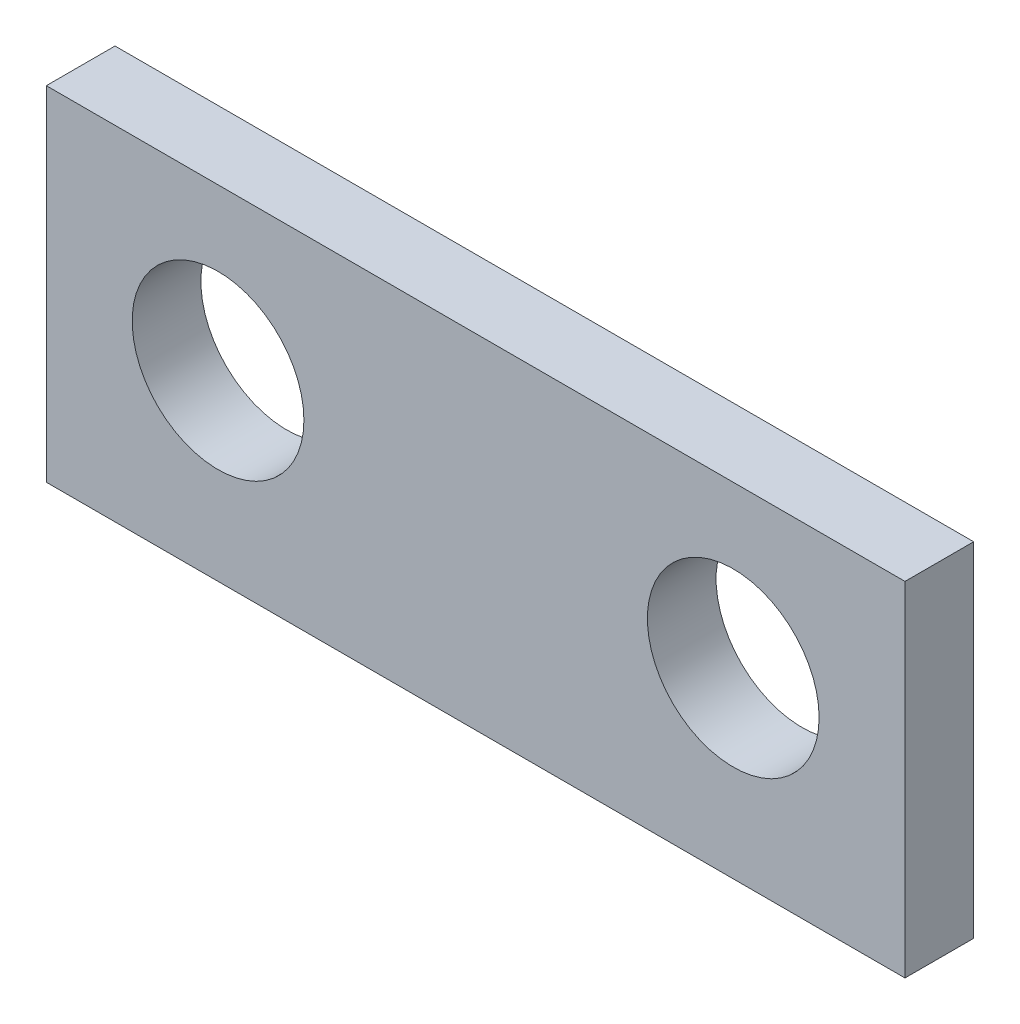
ISO-10303-21;
HEADER;
FILE_DESCRIPTION(('STEP AP214'),'2;1');
FILE_NAME('part.step','',(''),(''),'','','');
FILE_SCHEMA(('AUTOMOTIVE_DESIGN { 1 0 10303 214 1 1 1 1 }'));
ENDSEC;
DATA;
#1=APPLICATION_CONTEXT('core data for automotive mechanical design processes');
#2=APPLICATION_PROTOCOL_DEFINITION('international standard','automotive_design',2000,#1);
#3=PRODUCT_CONTEXT('',#1,'mechanical');
#4=PRODUCT('Part','Part','',(#3));
#5=PRODUCT_RELATED_PRODUCT_CATEGORY('part','',(#4));
#6=PRODUCT_DEFINITION_FORMATION('','',#4);
#7=PRODUCT_DEFINITION_CONTEXT('part definition',#1,'design');
#8=PRODUCT_DEFINITION('design','',#6,#7);
#9=PRODUCT_DEFINITION_SHAPE('','',#8);
#10=(LENGTH_UNIT() NAMED_UNIT(*) SI_UNIT(.MILLI.,.METRE.));
#11=(NAMED_UNIT(*) PLANE_ANGLE_UNIT() SI_UNIT($,.RADIAN.));
#12=(NAMED_UNIT(*) SI_UNIT($,.STERADIAN.) SOLID_ANGLE_UNIT());
#13=UNCERTAINTY_MEASURE_WITH_UNIT(LENGTH_MEASURE(1.E-05),#10,'distance_accuracy_value','');
#14=(GEOMETRIC_REPRESENTATION_CONTEXT(3) GLOBAL_UNCERTAINTY_ASSIGNED_CONTEXT((#13)) GLOBAL_UNIT_ASSIGNED_CONTEXT((#10,
#11,#12)) REPRESENTATION_CONTEXT('',''));
#15=CARTESIAN_POINT('',(0.,0.,0.));
#16=DIRECTION('',(0.,0.,1.));
#17=DIRECTION('',(1.,0.,0.));
#18=AXIS2_PLACEMENT_3D('',#15,#16,#17);
#19=CARTESIAN_POINT('',(0.,0.,2.54));
#20=DIRECTION('',(0.,0.,-1.));
#21=DIRECTION('',(-1.,0.,0.));
#22=AXIS2_PLACEMENT_3D('',#19,#20,#21);
#23=PLANE('',#22);
#24=CARTESIAN_POINT('',(6.35,6.75303764773476,2.54));
#25=DIRECTION('',(0.,0.,1.));
#26=DIRECTION('',(1.,0.,0.));
#27=AXIS2_PLACEMENT_3D('',#24,#25,#26);
#28=CIRCLE('',#27,3.175);
#29=CARTESIAN_POINT('',(9.525,6.75303764773476,2.54));
#30=VERTEX_POINT('',#29);
#31=EDGE_CURVE('E100',#30,#30,#28,.T.);
#32=ORIENTED_EDGE('',*,*,#31,.F.);
#33=EDGE_LOOP('',(#32));
#34=FACE_BOUND('',#33,.T.);
#35=DIRECTION('',(0.,-1.,0.));
#36=VECTOR('',#35,1.);
#37=CARTESIAN_POINT('',(0.,0.,2.54));
#38=LINE('',#37,#36);
#39=CARTESIAN_POINT('',(0.,12.7,2.54));
#40=VERTEX_POINT('',#39);
#41=CARTESIAN_POINT('',(0.,0.,2.54));
#42=VERTEX_POINT('',#41);
#43=EDGE_CURVE('E85',#40,#42,#38,.T.);
#44=ORIENTED_EDGE('',*,*,#43,.T.);
#45=DIRECTION('',(1.,0.,0.));
#46=VECTOR('',#45,1.);
#47=CARTESIAN_POINT('',(0.,0.,2.54));
#48=LINE('',#47,#46);
#49=CARTESIAN_POINT('',(31.75,0.,2.54));
#50=VERTEX_POINT('',#49);
#51=EDGE_CURVE('E80',#42,#50,#48,.T.);
#52=ORIENTED_EDGE('',*,*,#51,.T.);
#53=DIRECTION('',(0.,1.,0.));
#54=VECTOR('',#53,1.);
#55=CARTESIAN_POINT('',(31.75,0.,2.54));
#56=LINE('',#55,#54);
#57=CARTESIAN_POINT('',(31.75,12.7,2.54));
#58=VERTEX_POINT('',#57);
#59=EDGE_CURVE('E83',#50,#58,#56,.T.);
#60=ORIENTED_EDGE('',*,*,#59,.T.);
#61=DIRECTION('',(-1.,0.,0.));
#62=VECTOR('',#61,1.);
#63=CARTESIAN_POINT('',(0.,12.7,2.54));
#64=LINE('',#63,#62);
#65=EDGE_CURVE('E50',#58,#40,#64,.T.);
#66=ORIENTED_EDGE('',*,*,#65,.T.);
#67=EDGE_LOOP('',(#44,#52,#60,#66));
#68=FACE_BOUND('',#67,.T.);
#69=CARTESIAN_POINT('',(25.4,6.75303764773476,2.54));
#70=DIRECTION('',(0.,0.,1.));
#71=DIRECTION('',(1.,0.,0.));
#72=AXIS2_PLACEMENT_3D('',#69,#70,#71);
#73=CIRCLE('',#72,3.175);
#74=CARTESIAN_POINT('',(28.575,6.75303764773476,2.54));
#75=VERTEX_POINT('',#74);
#76=EDGE_CURVE('E115',#75,#75,#73,.T.);
#77=ORIENTED_EDGE('',*,*,#76,.F.);
#78=EDGE_LOOP('',(#77));
#79=FACE_BOUND('',#78,.T.);
#80=ADVANCED_FACE('F33',(#34,#68,#79),#23,.F.);
#81=CARTESIAN_POINT('',(0.,0.,0.));
#82=DIRECTION('',(0.,0.,-1.));
#83=DIRECTION('',(-1.,0.,0.));
#84=AXIS2_PLACEMENT_3D('',#81,#82,#83);
#85=PLANE('',#84);
#86=CARTESIAN_POINT('',(6.35,6.75303764773476,0.));
#87=DIRECTION('',(0.,0.,1.));
#88=DIRECTION('',(1.,0.,0.));
#89=AXIS2_PLACEMENT_3D('',#86,#87,#88);
#90=CIRCLE('',#89,3.175);
#91=CARTESIAN_POINT('',(9.525,6.75303764773476,0.));
#92=VERTEX_POINT('',#91);
#93=EDGE_CURVE('E112',#92,#92,#90,.T.);
#94=ORIENTED_EDGE('',*,*,#93,.T.);
#95=EDGE_LOOP('',(#94));
#96=FACE_BOUND('',#95,.T.);
#97=DIRECTION('',(0.,-1.,0.));
#98=VECTOR('',#97,1.);
#99=CARTESIAN_POINT('',(0.,0.,0.));
#100=LINE('',#99,#98);
#101=CARTESIAN_POINT('',(0.,12.7,0.));
#102=VERTEX_POINT('',#101);
#103=CARTESIAN_POINT('',(0.,0.,0.));
#104=VERTEX_POINT('',#103);
#105=EDGE_CURVE('E97',#102,#104,#100,.T.);
#106=ORIENTED_EDGE('',*,*,#105,.F.);
#107=DIRECTION('',(-1.,0.,0.));
#108=VECTOR('',#107,1.);
#109=CARTESIAN_POINT('',(0.,12.7,0.));
#110=LINE('',#109,#108);
#111=CARTESIAN_POINT('',(31.75,12.7,0.));
#112=VERTEX_POINT('',#111);
#113=EDGE_CURVE('E73',#112,#102,#110,.T.);
#114=ORIENTED_EDGE('',*,*,#113,.F.);
#115=DIRECTION('',(0.,1.,0.));
#116=VECTOR('',#115,1.);
#117=CARTESIAN_POINT('',(31.75,0.,0.));
#118=LINE('',#117,#116);
#119=CARTESIAN_POINT('',(31.75,0.,0.));
#120=VERTEX_POINT('',#119);
#121=EDGE_CURVE('E67',#120,#112,#118,.T.);
#122=ORIENTED_EDGE('',*,*,#121,.F.);
#123=DIRECTION('',(1.,0.,0.));
#124=VECTOR('',#123,1.);
#125=CARTESIAN_POINT('',(0.,0.,0.));
#126=LINE('',#125,#124);
#127=EDGE_CURVE('E89',#104,#120,#126,.T.);
#128=ORIENTED_EDGE('',*,*,#127,.F.);
#129=EDGE_LOOP('',(#106,#114,#122,#128));
#130=FACE_BOUND('',#129,.T.);
#131=CARTESIAN_POINT('',(25.4,6.75303764773476,0.));
#132=DIRECTION('',(0.,0.,1.));
#133=DIRECTION('',(1.,0.,0.));
#134=AXIS2_PLACEMENT_3D('',#131,#132,#133);
#135=CIRCLE('',#134,3.175);
#136=CARTESIAN_POINT('',(28.575,6.75303764773476,0.));
#137=VERTEX_POINT('',#136);
#138=EDGE_CURVE('E118',#137,#137,#135,.T.);
#139=ORIENTED_EDGE('',*,*,#138,.T.);
#140=EDGE_LOOP('',(#139));
#141=FACE_BOUND('',#140,.T.);
#142=ADVANCED_FACE('F108',(#96,#130,#141),#85,.T.);
#143=CARTESIAN_POINT('',(0.,0.,2.54));
#144=DIRECTION('',(1.,0.,0.));
#145=DIRECTION('',(0.,0.,-1.));
#146=AXIS2_PLACEMENT_3D('',#143,#144,#145);
#147=PLANE('',#146);
#148=ORIENTED_EDGE('',*,*,#105,.T.);
#149=DIRECTION('',(0.,0.,-1.));
#150=VECTOR('',#149,1.);
#151=CARTESIAN_POINT('',(0.,0.,2.54));
#152=LINE('',#151,#150);
#153=EDGE_CURVE('E11',#42,#104,#152,.T.);
#154=ORIENTED_EDGE('',*,*,#153,.F.);
#155=ORIENTED_EDGE('',*,*,#43,.F.);
#156=DIRECTION('',(0.,0.,-1.));
#157=VECTOR('',#156,1.);
#158=CARTESIAN_POINT('',(0.,12.7,2.54));
#159=LINE('',#158,#157);
#160=EDGE_CURVE('E93',#40,#102,#159,.T.);
#161=ORIENTED_EDGE('',*,*,#160,.T.);
#162=EDGE_LOOP('',(#148,#154,#155,#161));
#163=FACE_BOUND('',#162,.T.);
#164=ADVANCED_FACE('F35',(#163),#147,.F.);
#165=CARTESIAN_POINT('',(0.,0.,2.54));
#166=DIRECTION('',(0.,1.,0.));
#167=DIRECTION('',(0.,0.,1.));
#168=AXIS2_PLACEMENT_3D('',#165,#166,#167);
#169=PLANE('',#168);
#170=ORIENTED_EDGE('',*,*,#127,.T.);
#171=DIRECTION('',(0.,0.,-1.));
#172=VECTOR('',#171,1.);
#173=CARTESIAN_POINT('',(31.75,0.,2.54));
#174=LINE('',#173,#172);
#175=EDGE_CURVE('E42',#50,#120,#174,.T.);
#176=ORIENTED_EDGE('',*,*,#175,.F.);
#177=ORIENTED_EDGE('',*,*,#51,.F.);
#178=ORIENTED_EDGE('',*,*,#153,.T.);
#179=EDGE_LOOP('',(#170,#176,#177,#178));
#180=FACE_BOUND('',#179,.T.);
#181=ADVANCED_FACE('F88',(#180),#169,.F.);
#182=CARTESIAN_POINT('',(31.75,0.,2.54));
#183=DIRECTION('',(-1.,0.,0.));
#184=DIRECTION('',(0.,0.,1.));
#185=AXIS2_PLACEMENT_3D('',#182,#183,#184);
#186=PLANE('',#185);
#187=ORIENTED_EDGE('',*,*,#121,.T.);
#188=DIRECTION('',(0.,0.,-1.));
#189=VECTOR('',#188,1.);
#190=CARTESIAN_POINT('',(31.75,12.7,2.54));
#191=LINE('',#190,#189);
#192=EDGE_CURVE('E90',#58,#112,#191,.T.);
#193=ORIENTED_EDGE('',*,*,#192,.F.);
#194=ORIENTED_EDGE('',*,*,#59,.F.);
#195=ORIENTED_EDGE('',*,*,#175,.T.);
#196=EDGE_LOOP('',(#187,#193,#194,#195));
#197=FACE_BOUND('',#196,.T.);
#198=ADVANCED_FACE('F91',(#197),#186,.F.);
#199=CARTESIAN_POINT('',(0.,12.7,2.54));
#200=DIRECTION('',(0.,-1.,0.));
#201=DIRECTION('',(0.,0.,-1.));
#202=AXIS2_PLACEMENT_3D('',#199,#200,#201);
#203=PLANE('',#202);
#204=ORIENTED_EDGE('',*,*,#113,.T.);
#205=ORIENTED_EDGE('',*,*,#160,.F.);
#206=ORIENTED_EDGE('',*,*,#65,.F.);
#207=ORIENTED_EDGE('',*,*,#192,.T.);
#208=EDGE_LOOP('',(#204,#205,#206,#207));
#209=FACE_BOUND('',#208,.T.);
#210=ADVANCED_FACE('F105',(#209),#203,.F.);
#211=CARTESIAN_POINT('',(6.35,6.75303764773476,2.54));
#212=DIRECTION('',(0.,0.,-1.));
#213=DIRECTION('',(-1.,0.,0.));
#214=AXIS2_PLACEMENT_3D('',#211,#212,#213);
#215=CYLINDRICAL_SURFACE('',#214,3.175);
#216=ORIENTED_EDGE('',*,*,#31,.T.);
#217=EDGE_LOOP('',(#216));
#218=FACE_BOUND('',#217,.T.);
#219=ORIENTED_EDGE('',*,*,#93,.F.);
#220=EDGE_LOOP('',(#219));
#221=FACE_BOUND('',#220,.T.);
#222=ADVANCED_FACE('F136',(#218,#221),#215,.F.);
#223=CARTESIAN_POINT('',(25.4,6.75303764773476,2.54));
#224=DIRECTION('',(0.,0.,-1.));
#225=DIRECTION('',(-1.,0.,0.));
#226=AXIS2_PLACEMENT_3D('',#223,#224,#225);
#227=CYLINDRICAL_SURFACE('',#226,3.175);
#228=ORIENTED_EDGE('',*,*,#76,.T.);
#229=EDGE_LOOP('',(#228));
#230=FACE_BOUND('',#229,.T.);
#231=ORIENTED_EDGE('',*,*,#138,.F.);
#232=EDGE_LOOP('',(#231));
#233=FACE_BOUND('',#232,.T.);
#234=ADVANCED_FACE('F124',(#230,#233),#227,.F.);
#235=CLOSED_SHELL('',(#80,#142,#164,#181,#198,#210,#222,#234));
#236=MANIFOLD_SOLID_BREP('B2',#235);
#237=ADVANCED_BREP_SHAPE_REPRESENTATION('',(#18,#236),#14);
#238=SHAPE_DEFINITION_REPRESENTATION(#9,#237);
ENDSEC;
END-ISO-10303-21;
